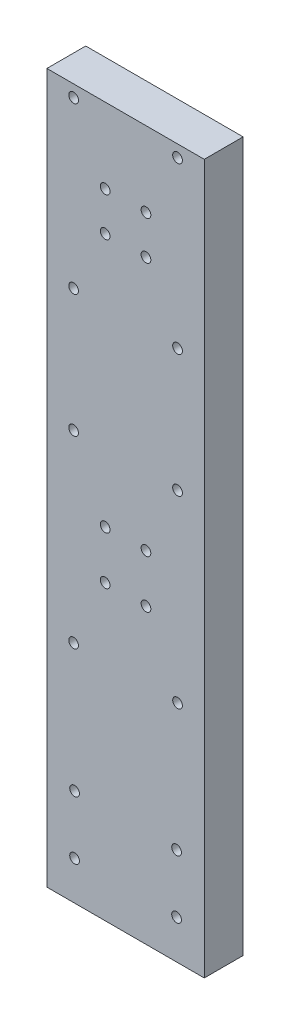
ISO-10303-21;
HEADER;
FILE_DESCRIPTION(('STEP AP214'),'2;1');
FILE_NAME('part.step','',(''),(''),'','','');
FILE_SCHEMA(('AUTOMOTIVE_DESIGN { 1 0 10303 214 1 1 1 1 }'));
ENDSEC;
DATA;
#1=APPLICATION_CONTEXT('core data for automotive mechanical design processes');
#2=APPLICATION_PROTOCOL_DEFINITION('international standard','automotive_design',2000,#1);
#3=PRODUCT_CONTEXT('',#1,'mechanical');
#4=PRODUCT('Part','Part','',(#3));
#5=PRODUCT_RELATED_PRODUCT_CATEGORY('part','',(#4));
#6=PRODUCT_DEFINITION_FORMATION('','',#4);
#7=PRODUCT_DEFINITION_CONTEXT('part definition',#1,'design');
#8=PRODUCT_DEFINITION('design','',#6,#7);
#9=PRODUCT_DEFINITION_SHAPE('','',#8);
#10=(LENGTH_UNIT() NAMED_UNIT(*) SI_UNIT(.MILLI.,.METRE.));
#11=(NAMED_UNIT(*) PLANE_ANGLE_UNIT() SI_UNIT($,.RADIAN.));
#12=(NAMED_UNIT(*) SI_UNIT($,.STERADIAN.) SOLID_ANGLE_UNIT());
#13=UNCERTAINTY_MEASURE_WITH_UNIT(LENGTH_MEASURE(1.E-05),#10,'distance_accuracy_value','');
#14=(GEOMETRIC_REPRESENTATION_CONTEXT(3) GLOBAL_UNCERTAINTY_ASSIGNED_CONTEXT((#13)) GLOBAL_UNIT_ASSIGNED_CONTEXT((#10,
#11,#12)) REPRESENTATION_CONTEXT('',''));
#15=CARTESIAN_POINT('',(0.,0.,0.));
#16=DIRECTION('',(0.,0.,1.));
#17=DIRECTION('',(1.,0.,0.));
#18=AXIS2_PLACEMENT_3D('',#15,#16,#17);
#19=CARTESIAN_POINT('',(0.,0.,4.));
#20=DIRECTION('',(0.,0.,-1.));
#21=DIRECTION('',(-1.,0.,0.));
#22=AXIS2_PLACEMENT_3D('',#19,#20,#21);
#23=PLANE('',#22);
#24=CARTESIAN_POINT('',(10.1999999999987,65.26,4.));
#25=DIRECTION('',(0.,0.,1.));
#26=DIRECTION('',(-1.,0.,0.));
#27=AXIS2_PLACEMENT_3D('',#24,#25,#26);
#28=CIRCLE('',#27,0.499999999999999);
#29=CARTESIAN_POINT('',(9.69999999999869,65.26,4.));
#30=VERTEX_POINT('',#29);
#31=EDGE_CURVE('E217',#30,#30,#28,.T.);
#32=ORIENTED_EDGE('',*,*,#31,.F.);
#33=EDGE_LOOP('',(#32));
#34=FACE_BOUND('',#33,.T.);
#35=CARTESIAN_POINT('',(2.7500000000006,54.76,4.));
#36=DIRECTION('',(0.,0.,1.));
#37=DIRECTION('',(1.,0.,0.));
#38=AXIS2_PLACEMENT_3D('',#35,#36,#37);
#39=CIRCLE('',#38,0.500000000000005);
#40=CARTESIAN_POINT('',(3.2500000000006,54.76,4.));
#41=VERTEX_POINT('',#40);
#42=EDGE_CURVE('E205',#41,#41,#39,.T.);
#43=ORIENTED_EDGE('',*,*,#42,.F.);
#44=EDGE_LOOP('',(#43));
#45=FACE_BOUND('',#44,.T.);
#46=CARTESIAN_POINT('',(13.350000000001,10.,4.));
#47=DIRECTION('',(0.,0.,1.));
#48=DIRECTION('',(-1.,0.,0.));
#49=AXIS2_PLACEMENT_3D('',#46,#47,#48);
#50=CIRCLE('',#49,0.499999999999994);
#51=CARTESIAN_POINT('',(12.850000000001,10.,4.));
#52=VERTEX_POINT('',#51);
#53=EDGE_CURVE('E193',#52,#52,#50,.T.);
#54=ORIENTED_EDGE('',*,*,#53,.F.);
#55=EDGE_LOOP('',(#54));
#56=FACE_BOUND('',#55,.T.);
#57=CARTESIAN_POINT('',(13.4500000000019,54.76,4.));
#58=DIRECTION('',(0.,0.,1.));
#59=DIRECTION('',(1.,0.,0.));
#60=AXIS2_PLACEMENT_3D('',#57,#58,#59);
#61=CIRCLE('',#60,0.499999999999999);
#62=CARTESIAN_POINT('',(13.9500000000019,54.76,4.));
#63=VERTEX_POINT('',#62);
#64=EDGE_CURVE('E181',#63,#63,#61,.T.);
#65=ORIENTED_EDGE('',*,*,#64,.F.);
#66=EDGE_LOOP('',(#65));
#67=FACE_BOUND('',#66,.T.);
#68=CARTESIAN_POINT('',(2.84999999999999,10.,4.));
#69=DIRECTION('',(0.,0.,1.));
#70=DIRECTION('',(1.,0.,0.));
#71=AXIS2_PLACEMENT_3D('',#68,#69,#70);
#72=CIRCLE('',#71,0.499999999999999);
#73=CARTESIAN_POINT('',(3.34999999999999,10.,4.));
#74=VERTEX_POINT('',#73);
#75=EDGE_CURVE('E169',#74,#74,#72,.T.);
#76=ORIENTED_EDGE('',*,*,#75,.F.);
#77=EDGE_LOOP('',(#76));
#78=FACE_BOUND('',#77,.T.);
#79=CARTESIAN_POINT('',(6.00000000000001,35.11,4.));
#80=DIRECTION('',(0.,0.,1.));
#81=DIRECTION('',(1.,0.,0.));
#82=AXIS2_PLACEMENT_3D('',#79,#80,#81);
#83=CIRCLE('',#82,0.500000000000002);
#84=CARTESIAN_POINT('',(6.50000000000001,35.11,4.));
#85=VERTEX_POINT('',#84);
#86=EDGE_CURVE('E157',#85,#85,#83,.T.);
#87=ORIENTED_EDGE('',*,*,#86,.F.);
#88=EDGE_LOOP('',(#87));
#89=FACE_BOUND('',#88,.T.);
#90=CARTESIAN_POINT('',(10.2000000000001,35.11,4.));
#91=DIRECTION('',(0.,0.,1.));
#92=DIRECTION('',(1.,0.,0.));
#93=AXIS2_PLACEMENT_3D('',#90,#91,#92);
#94=CIRCLE('',#93,0.499999999999999);
#95=CARTESIAN_POINT('',(10.7000000000001,35.11,4.));
#96=VERTEX_POINT('',#95);
#97=EDGE_CURVE('E145',#96,#96,#94,.T.);
#98=ORIENTED_EDGE('',*,*,#97,.F.);
#99=EDGE_LOOP('',(#98));
#100=FACE_BOUND('',#99,.T.);
#101=CARTESIAN_POINT('',(6.00000000000001,30.15,4.));
#102=DIRECTION('',(0.,0.,1.));
#103=DIRECTION('',(1.,0.,0.));
#104=AXIS2_PLACEMENT_3D('',#101,#102,#103);
#105=CIRCLE('',#104,0.5);
#106=CARTESIAN_POINT('',(6.50000000000001,30.15,4.));
#107=VERTEX_POINT('',#106);
#108=EDGE_CURVE('E133',#107,#107,#105,.T.);
#109=ORIENTED_EDGE('',*,*,#108,.F.);
#110=EDGE_LOOP('',(#109));
#111=FACE_BOUND('',#110,.T.);
#112=CARTESIAN_POINT('',(5.99999999999857,61.26,4.));
#113=DIRECTION('',(0.,0.,1.));
#114=DIRECTION('',(1.,0.,0.));
#115=AXIS2_PLACEMENT_3D('',#112,#113,#114);
#116=CIRCLE('',#115,0.500000000000003);
#117=CARTESIAN_POINT('',(6.49999999999857,61.26,4.));
#118=VERTEX_POINT('',#117);
#119=EDGE_CURVE('E121',#118,#118,#116,.T.);
#120=ORIENTED_EDGE('',*,*,#119,.F.);
#121=EDGE_LOOP('',(#120));
#122=FACE_BOUND('',#121,.T.);
#123=CARTESIAN_POINT('',(2.75000000000059,71.76,4.));
#124=DIRECTION('',(0.,0.,1.));
#125=DIRECTION('',(-1.,0.,0.));
#126=AXIS2_PLACEMENT_3D('',#123,#124,#125);
#127=CIRCLE('',#126,0.500000000000005);
#128=CARTESIAN_POINT('',(2.25000000000058,71.76,4.));
#129=VERTEX_POINT('',#128);
#130=EDGE_CURVE('E100',#129,#129,#127,.T.);
#131=ORIENTED_EDGE('',*,*,#130,.F.);
#132=EDGE_LOOP('',(#131));
#133=FACE_BOUND('',#132,.T.);
#134=DIRECTION('',(1.,0.,0.));
#135=VECTOR('',#134,1.);
#136=CARTESIAN_POINT('',(0.,0.,4.));
#137=LINE('',#136,#135);
#138=CARTESIAN_POINT('',(0.,0.,4.));
#139=VERTEX_POINT('',#138);
#140=CARTESIAN_POINT('',(16.2,0.,4.));
#141=VERTEX_POINT('',#140);
#142=EDGE_CURVE('E85',#139,#141,#137,.T.);
#143=ORIENTED_EDGE('',*,*,#142,.T.);
#144=DIRECTION('',(0.,1.,0.));
#145=VECTOR('',#144,1.);
#146=CARTESIAN_POINT('',(16.2,72.99,4.));
#147=LINE('',#146,#145);
#148=CARTESIAN_POINT('',(16.2,72.99,4.));
#149=VERTEX_POINT('',#148);
#150=EDGE_CURVE('E80',#141,#149,#147,.T.);
#151=ORIENTED_EDGE('',*,*,#150,.T.);
#152=DIRECTION('',(-1.,0.,0.));
#153=VECTOR('',#152,1.);
#154=CARTESIAN_POINT('',(0.,72.99,4.));
#155=LINE('',#154,#153);
#156=CARTESIAN_POINT('',(0.,72.99,4.));
#157=VERTEX_POINT('',#156);
#158=EDGE_CURVE('E83',#149,#157,#155,.T.);
#159=ORIENTED_EDGE('',*,*,#158,.T.);
#160=DIRECTION('',(0.,-1.,0.));
#161=VECTOR('',#160,1.);
#162=CARTESIAN_POINT('',(0.,0.,4.));
#163=LINE('',#162,#161);
#164=EDGE_CURVE('E50',#157,#139,#163,.T.);
#165=ORIENTED_EDGE('',*,*,#164,.T.);
#166=EDGE_LOOP('',(#143,#151,#159,#165));
#167=FACE_BOUND('',#166,.T.);
#168=CARTESIAN_POINT('',(10.1999999999987,61.26,4.));
#169=DIRECTION('',(0.,0.,1.));
#170=DIRECTION('',(1.,0.,0.));
#171=AXIS2_PLACEMENT_3D('',#168,#169,#170);
#172=CIRCLE('',#171,0.499999999999999);
#173=CARTESIAN_POINT('',(10.6999999999987,61.26,4.));
#174=VERTEX_POINT('',#173);
#175=EDGE_CURVE('E115',#174,#174,#172,.T.);
#176=ORIENTED_EDGE('',*,*,#175,.F.);
#177=EDGE_LOOP('',(#176));
#178=FACE_BOUND('',#177,.T.);
#179=CARTESIAN_POINT('',(10.2000000000001,30.15,4.));
#180=DIRECTION('',(0.,0.,1.));
#181=DIRECTION('',(1.,0.,0.));
#182=AXIS2_PLACEMENT_3D('',#179,#180,#181);
#183=CIRCLE('',#182,0.499999999999999);
#184=CARTESIAN_POINT('',(10.7000000000001,30.15,4.));
#185=VERTEX_POINT('',#184);
#186=EDGE_CURVE('E127',#185,#185,#183,.T.);
#187=ORIENTED_EDGE('',*,*,#186,.F.);
#188=EDGE_LOOP('',(#187));
#189=FACE_BOUND('',#188,.T.);
#190=CARTESIAN_POINT('',(13.4500000000001,23.15,4.));
#191=DIRECTION('',(0.,0.,1.));
#192=DIRECTION('',(1.,0.,0.));
#193=AXIS2_PLACEMENT_3D('',#190,#191,#192);
#194=CIRCLE('',#193,0.499999999999999);
#195=CARTESIAN_POINT('',(13.9500000000001,23.15,4.));
#196=VERTEX_POINT('',#195);
#197=EDGE_CURVE('E139',#196,#196,#194,.T.);
#198=ORIENTED_EDGE('',*,*,#197,.F.);
#199=EDGE_LOOP('',(#198));
#200=FACE_BOUND('',#199,.T.);
#201=CARTESIAN_POINT('',(2.75000000000003,23.15,4.));
#202=DIRECTION('',(0.,0.,1.));
#203=DIRECTION('',(1.,0.,0.));
#204=AXIS2_PLACEMENT_3D('',#201,#202,#203);
#205=CIRCLE('',#204,0.499999999999999);
#206=CARTESIAN_POINT('',(3.25000000000003,23.15,4.));
#207=VERTEX_POINT('',#206);
#208=EDGE_CURVE('E151',#207,#207,#205,.T.);
#209=ORIENTED_EDGE('',*,*,#208,.F.);
#210=EDGE_LOOP('',(#209));
#211=FACE_BOUND('',#210,.T.);
#212=CARTESIAN_POINT('',(13.45,42.11,4.));
#213=DIRECTION('',(0.,0.,1.));
#214=DIRECTION('',(1.,0.,0.));
#215=AXIS2_PLACEMENT_3D('',#212,#213,#214);
#216=CIRCLE('',#215,0.499999999999999);
#217=CARTESIAN_POINT('',(13.95,42.11,4.));
#218=VERTEX_POINT('',#217);
#219=EDGE_CURVE('E163',#218,#218,#216,.T.);
#220=ORIENTED_EDGE('',*,*,#219,.F.);
#221=EDGE_LOOP('',(#220));
#222=FACE_BOUND('',#221,.T.);
#223=CARTESIAN_POINT('',(2.75000000000003,42.11,4.));
#224=DIRECTION('',(0.,0.,1.));
#225=DIRECTION('',(1.,0.,0.));
#226=AXIS2_PLACEMENT_3D('',#223,#224,#225);
#227=CIRCLE('',#226,0.499999999999999);
#228=CARTESIAN_POINT('',(3.25000000000003,42.11,4.));
#229=VERTEX_POINT('',#228);
#230=EDGE_CURVE('E175',#229,#229,#227,.T.);
#231=ORIENTED_EDGE('',*,*,#230,.F.);
#232=EDGE_LOOP('',(#231));
#233=FACE_BOUND('',#232,.T.);
#234=CARTESIAN_POINT('',(2.84999999999999,4.,4.));
#235=DIRECTION('',(0.,0.,1.));
#236=DIRECTION('',(1.,0.,0.));
#237=AXIS2_PLACEMENT_3D('',#234,#235,#236);
#238=CIRCLE('',#237,0.499999999999999);
#239=CARTESIAN_POINT('',(3.34999999999999,4.,4.));
#240=VERTEX_POINT('',#239);
#241=EDGE_CURVE('E187',#240,#240,#238,.T.);
#242=ORIENTED_EDGE('',*,*,#241,.F.);
#243=EDGE_LOOP('',(#242));
#244=FACE_BOUND('',#243,.T.);
#245=CARTESIAN_POINT('',(13.350000000001,4.,4.));
#246=DIRECTION('',(0.,0.,1.));
#247=DIRECTION('',(-1.,0.,0.));
#248=AXIS2_PLACEMENT_3D('',#245,#246,#247);
#249=CIRCLE('',#248,0.499999999999995);
#250=CARTESIAN_POINT('',(12.850000000001,4.,4.));
#251=VERTEX_POINT('',#250);
#252=EDGE_CURVE('E199',#251,#251,#249,.T.);
#253=ORIENTED_EDGE('',*,*,#252,.F.);
#254=EDGE_LOOP('',(#253));
#255=FACE_BOUND('',#254,.T.);
#256=CARTESIAN_POINT('',(5.99999999999856,65.26,4.));
#257=DIRECTION('',(0.,0.,1.));
#258=DIRECTION('',(-1.,0.,0.));
#259=AXIS2_PLACEMENT_3D('',#256,#257,#258);
#260=CIRCLE('',#259,0.500000000000003);
#261=CARTESIAN_POINT('',(5.49999999999856,65.26,4.));
#262=VERTEX_POINT('',#261);
#263=EDGE_CURVE('E211',#262,#262,#260,.T.);
#264=ORIENTED_EDGE('',*,*,#263,.F.);
#265=EDGE_LOOP('',(#264));
#266=FACE_BOUND('',#265,.T.);
#267=CARTESIAN_POINT('',(13.4500000000019,71.76,4.));
#268=DIRECTION('',(0.,0.,1.));
#269=DIRECTION('',(-1.,0.,0.));
#270=AXIS2_PLACEMENT_3D('',#267,#268,#269);
#271=CIRCLE('',#270,0.500000000000006);
#272=CARTESIAN_POINT('',(12.9500000000019,71.76,4.));
#273=VERTEX_POINT('',#272);
#274=EDGE_CURVE('E223',#273,#273,#271,.T.);
#275=ORIENTED_EDGE('',*,*,#274,.F.);
#276=EDGE_LOOP('',(#275));
#277=FACE_BOUND('',#276,.T.);
#278=ADVANCED_FACE('F33',(#34,#45,#56,#67,#78,#89,#100,#111,#122,#133,#167,#178,#189,#200,#211,
#222,#233,#244,#255,#266,#277),#23,.F.);
#279=CARTESIAN_POINT('',(0.,0.,0.));
#280=DIRECTION('',(0.,0.,-1.));
#281=DIRECTION('',(-1.,0.,0.));
#282=AXIS2_PLACEMENT_3D('',#279,#280,#281);
#283=PLANE('',#282);
#284=CARTESIAN_POINT('',(10.1999999999987,65.26,0.));
#285=DIRECTION('',(0.,0.,1.));
#286=DIRECTION('',(-1.,0.,0.));
#287=AXIS2_PLACEMENT_3D('',#284,#285,#286);
#288=CIRCLE('',#287,0.499999999999999);
#289=CARTESIAN_POINT('',(9.69999999999869,65.26,0.));
#290=VERTEX_POINT('',#289);
#291=EDGE_CURVE('E220',#290,#290,#288,.T.);
#292=ORIENTED_EDGE('',*,*,#291,.T.);
#293=EDGE_LOOP('',(#292));
#294=FACE_BOUND('',#293,.T.);
#295=CARTESIAN_POINT('',(2.7500000000006,54.76,0.));
#296=DIRECTION('',(0.,0.,1.));
#297=DIRECTION('',(1.,0.,0.));
#298=AXIS2_PLACEMENT_3D('',#295,#296,#297);
#299=CIRCLE('',#298,0.500000000000005);
#300=CARTESIAN_POINT('',(3.2500000000006,54.76,0.));
#301=VERTEX_POINT('',#300);
#302=EDGE_CURVE('E208',#301,#301,#299,.T.);
#303=ORIENTED_EDGE('',*,*,#302,.T.);
#304=EDGE_LOOP('',(#303));
#305=FACE_BOUND('',#304,.T.);
#306=CARTESIAN_POINT('',(13.350000000001,10.,0.));
#307=DIRECTION('',(0.,0.,1.));
#308=DIRECTION('',(-1.,0.,0.));
#309=AXIS2_PLACEMENT_3D('',#306,#307,#308);
#310=CIRCLE('',#309,0.499999999999994);
#311=CARTESIAN_POINT('',(12.850000000001,10.,0.));
#312=VERTEX_POINT('',#311);
#313=EDGE_CURVE('E196',#312,#312,#310,.T.);
#314=ORIENTED_EDGE('',*,*,#313,.T.);
#315=EDGE_LOOP('',(#314));
#316=FACE_BOUND('',#315,.T.);
#317=CARTESIAN_POINT('',(13.4500000000019,54.76,0.));
#318=DIRECTION('',(0.,0.,1.));
#319=DIRECTION('',(1.,0.,0.));
#320=AXIS2_PLACEMENT_3D('',#317,#318,#319);
#321=CIRCLE('',#320,0.499999999999999);
#322=CARTESIAN_POINT('',(13.9500000000019,54.76,0.));
#323=VERTEX_POINT('',#322);
#324=EDGE_CURVE('E184',#323,#323,#321,.T.);
#325=ORIENTED_EDGE('',*,*,#324,.T.);
#326=EDGE_LOOP('',(#325));
#327=FACE_BOUND('',#326,.T.);
#328=CARTESIAN_POINT('',(2.84999999999999,10.,0.));
#329=DIRECTION('',(0.,0.,1.));
#330=DIRECTION('',(1.,0.,0.));
#331=AXIS2_PLACEMENT_3D('',#328,#329,#330);
#332=CIRCLE('',#331,0.499999999999999);
#333=CARTESIAN_POINT('',(3.34999999999999,10.,0.));
#334=VERTEX_POINT('',#333);
#335=EDGE_CURVE('E172',#334,#334,#332,.T.);
#336=ORIENTED_EDGE('',*,*,#335,.T.);
#337=EDGE_LOOP('',(#336));
#338=FACE_BOUND('',#337,.T.);
#339=CARTESIAN_POINT('',(6.00000000000001,35.11,0.));
#340=DIRECTION('',(0.,0.,1.));
#341=DIRECTION('',(1.,0.,0.));
#342=AXIS2_PLACEMENT_3D('',#339,#340,#341);
#343=CIRCLE('',#342,0.500000000000002);
#344=CARTESIAN_POINT('',(6.50000000000001,35.11,0.));
#345=VERTEX_POINT('',#344);
#346=EDGE_CURVE('E160',#345,#345,#343,.T.);
#347=ORIENTED_EDGE('',*,*,#346,.T.);
#348=EDGE_LOOP('',(#347));
#349=FACE_BOUND('',#348,.T.);
#350=CARTESIAN_POINT('',(10.2000000000001,35.11,0.));
#351=DIRECTION('',(0.,0.,1.));
#352=DIRECTION('',(1.,0.,0.));
#353=AXIS2_PLACEMENT_3D('',#350,#351,#352);
#354=CIRCLE('',#353,0.499999999999999);
#355=CARTESIAN_POINT('',(10.7000000000001,35.11,0.));
#356=VERTEX_POINT('',#355);
#357=EDGE_CURVE('E148',#356,#356,#354,.T.);
#358=ORIENTED_EDGE('',*,*,#357,.T.);
#359=EDGE_LOOP('',(#358));
#360=FACE_BOUND('',#359,.T.);
#361=CARTESIAN_POINT('',(6.00000000000001,30.15,0.));
#362=DIRECTION('',(0.,0.,1.));
#363=DIRECTION('',(1.,0.,0.));
#364=AXIS2_PLACEMENT_3D('',#361,#362,#363);
#365=CIRCLE('',#364,0.5);
#366=CARTESIAN_POINT('',(6.50000000000001,30.15,0.));
#367=VERTEX_POINT('',#366);
#368=EDGE_CURVE('E136',#367,#367,#365,.T.);
#369=ORIENTED_EDGE('',*,*,#368,.T.);
#370=EDGE_LOOP('',(#369));
#371=FACE_BOUND('',#370,.T.);
#372=CARTESIAN_POINT('',(5.99999999999857,61.26,0.));
#373=DIRECTION('',(0.,0.,1.));
#374=DIRECTION('',(1.,0.,0.));
#375=AXIS2_PLACEMENT_3D('',#372,#373,#374);
#376=CIRCLE('',#375,0.500000000000003);
#377=CARTESIAN_POINT('',(6.49999999999857,61.26,0.));
#378=VERTEX_POINT('',#377);
#379=EDGE_CURVE('E124',#378,#378,#376,.T.);
#380=ORIENTED_EDGE('',*,*,#379,.T.);
#381=EDGE_LOOP('',(#380));
#382=FACE_BOUND('',#381,.T.);
#383=CARTESIAN_POINT('',(2.75000000000059,71.76,0.));
#384=DIRECTION('',(0.,0.,1.));
#385=DIRECTION('',(-1.,0.,0.));
#386=AXIS2_PLACEMENT_3D('',#383,#384,#385);
#387=CIRCLE('',#386,0.500000000000005);
#388=CARTESIAN_POINT('',(2.25000000000058,71.76,0.));
#389=VERTEX_POINT('',#388);
#390=EDGE_CURVE('E112',#389,#389,#387,.T.);
#391=ORIENTED_EDGE('',*,*,#390,.T.);
#392=EDGE_LOOP('',(#391));
#393=FACE_BOUND('',#392,.T.);
#394=DIRECTION('',(1.,0.,0.));
#395=VECTOR('',#394,1.);
#396=CARTESIAN_POINT('',(0.,0.,0.));
#397=LINE('',#396,#395);
#398=CARTESIAN_POINT('',(0.,0.,0.));
#399=VERTEX_POINT('',#398);
#400=CARTESIAN_POINT('',(16.2,0.,0.));
#401=VERTEX_POINT('',#400);
#402=EDGE_CURVE('E97',#399,#401,#397,.T.);
#403=ORIENTED_EDGE('',*,*,#402,.F.);
#404=DIRECTION('',(0.,-1.,0.));
#405=VECTOR('',#404,1.);
#406=CARTESIAN_POINT('',(0.,0.,0.));
#407=LINE('',#406,#405);
#408=CARTESIAN_POINT('',(0.,72.99,0.));
#409=VERTEX_POINT('',#408);
#410=EDGE_CURVE('E73',#409,#399,#407,.T.);
#411=ORIENTED_EDGE('',*,*,#410,.F.);
#412=DIRECTION('',(-1.,0.,0.));
#413=VECTOR('',#412,1.);
#414=CARTESIAN_POINT('',(0.,72.99,0.));
#415=LINE('',#414,#413);
#416=CARTESIAN_POINT('',(16.2,72.99,0.));
#417=VERTEX_POINT('',#416);
#418=EDGE_CURVE('E67',#417,#409,#415,.T.);
#419=ORIENTED_EDGE('',*,*,#418,.F.);
#420=DIRECTION('',(0.,1.,0.));
#421=VECTOR('',#420,1.);
#422=CARTESIAN_POINT('',(16.2,72.99,0.));
#423=LINE('',#422,#421);
#424=EDGE_CURVE('E89',#401,#417,#423,.T.);
#425=ORIENTED_EDGE('',*,*,#424,.F.);
#426=EDGE_LOOP('',(#403,#411,#419,#425));
#427=FACE_BOUND('',#426,.T.);
#428=CARTESIAN_POINT('',(10.1999999999987,61.26,0.));
#429=DIRECTION('',(0.,0.,1.));
#430=DIRECTION('',(1.,0.,0.));
#431=AXIS2_PLACEMENT_3D('',#428,#429,#430);
#432=CIRCLE('',#431,0.499999999999999);
#433=CARTESIAN_POINT('',(10.6999999999987,61.26,0.));
#434=VERTEX_POINT('',#433);
#435=EDGE_CURVE('E118',#434,#434,#432,.T.);
#436=ORIENTED_EDGE('',*,*,#435,.T.);
#437=EDGE_LOOP('',(#436));
#438=FACE_BOUND('',#437,.T.);
#439=CARTESIAN_POINT('',(10.2000000000001,30.15,0.));
#440=DIRECTION('',(0.,0.,1.));
#441=DIRECTION('',(1.,0.,0.));
#442=AXIS2_PLACEMENT_3D('',#439,#440,#441);
#443=CIRCLE('',#442,0.499999999999999);
#444=CARTESIAN_POINT('',(10.7000000000001,30.15,0.));
#445=VERTEX_POINT('',#444);
#446=EDGE_CURVE('E130',#445,#445,#443,.T.);
#447=ORIENTED_EDGE('',*,*,#446,.T.);
#448=EDGE_LOOP('',(#447));
#449=FACE_BOUND('',#448,.T.);
#450=CARTESIAN_POINT('',(13.4500000000001,23.15,0.));
#451=DIRECTION('',(0.,0.,1.));
#452=DIRECTION('',(1.,0.,0.));
#453=AXIS2_PLACEMENT_3D('',#450,#451,#452);
#454=CIRCLE('',#453,0.499999999999999);
#455=CARTESIAN_POINT('',(13.9500000000001,23.15,0.));
#456=VERTEX_POINT('',#455);
#457=EDGE_CURVE('E142',#456,#456,#454,.T.);
#458=ORIENTED_EDGE('',*,*,#457,.T.);
#459=EDGE_LOOP('',(#458));
#460=FACE_BOUND('',#459,.T.);
#461=CARTESIAN_POINT('',(2.75000000000003,23.15,0.));
#462=DIRECTION('',(0.,0.,1.));
#463=DIRECTION('',(1.,0.,0.));
#464=AXIS2_PLACEMENT_3D('',#461,#462,#463);
#465=CIRCLE('',#464,0.499999999999999);
#466=CARTESIAN_POINT('',(3.25000000000003,23.15,0.));
#467=VERTEX_POINT('',#466);
#468=EDGE_CURVE('E154',#467,#467,#465,.T.);
#469=ORIENTED_EDGE('',*,*,#468,.T.);
#470=EDGE_LOOP('',(#469));
#471=FACE_BOUND('',#470,.T.);
#472=CARTESIAN_POINT('',(13.45,42.11,0.));
#473=DIRECTION('',(0.,0.,1.));
#474=DIRECTION('',(1.,0.,0.));
#475=AXIS2_PLACEMENT_3D('',#472,#473,#474);
#476=CIRCLE('',#475,0.499999999999999);
#477=CARTESIAN_POINT('',(13.95,42.11,0.));
#478=VERTEX_POINT('',#477);
#479=EDGE_CURVE('E166',#478,#478,#476,.T.);
#480=ORIENTED_EDGE('',*,*,#479,.T.);
#481=EDGE_LOOP('',(#480));
#482=FACE_BOUND('',#481,.T.);
#483=CARTESIAN_POINT('',(2.75000000000003,42.11,0.));
#484=DIRECTION('',(0.,0.,1.));
#485=DIRECTION('',(1.,0.,0.));
#486=AXIS2_PLACEMENT_3D('',#483,#484,#485);
#487=CIRCLE('',#486,0.499999999999999);
#488=CARTESIAN_POINT('',(3.25000000000003,42.11,0.));
#489=VERTEX_POINT('',#488);
#490=EDGE_CURVE('E178',#489,#489,#487,.T.);
#491=ORIENTED_EDGE('',*,*,#490,.T.);
#492=EDGE_LOOP('',(#491));
#493=FACE_BOUND('',#492,.T.);
#494=CARTESIAN_POINT('',(2.84999999999999,4.,0.));
#495=DIRECTION('',(0.,0.,1.));
#496=DIRECTION('',(1.,0.,0.));
#497=AXIS2_PLACEMENT_3D('',#494,#495,#496);
#498=CIRCLE('',#497,0.499999999999999);
#499=CARTESIAN_POINT('',(3.34999999999999,4.,0.));
#500=VERTEX_POINT('',#499);
#501=EDGE_CURVE('E190',#500,#500,#498,.T.);
#502=ORIENTED_EDGE('',*,*,#501,.T.);
#503=EDGE_LOOP('',(#502));
#504=FACE_BOUND('',#503,.T.);
#505=CARTESIAN_POINT('',(13.350000000001,4.,0.));
#506=DIRECTION('',(0.,0.,1.));
#507=DIRECTION('',(-1.,0.,0.));
#508=AXIS2_PLACEMENT_3D('',#505,#506,#507);
#509=CIRCLE('',#508,0.499999999999995);
#510=CARTESIAN_POINT('',(12.850000000001,4.,0.));
#511=VERTEX_POINT('',#510);
#512=EDGE_CURVE('E202',#511,#511,#509,.T.);
#513=ORIENTED_EDGE('',*,*,#512,.T.);
#514=EDGE_LOOP('',(#513));
#515=FACE_BOUND('',#514,.T.);
#516=CARTESIAN_POINT('',(5.99999999999856,65.26,0.));
#517=DIRECTION('',(0.,0.,1.));
#518=DIRECTION('',(-1.,0.,0.));
#519=AXIS2_PLACEMENT_3D('',#516,#517,#518);
#520=CIRCLE('',#519,0.500000000000003);
#521=CARTESIAN_POINT('',(5.49999999999856,65.26,0.));
#522=VERTEX_POINT('',#521);
#523=EDGE_CURVE('E214',#522,#522,#520,.T.);
#524=ORIENTED_EDGE('',*,*,#523,.T.);
#525=EDGE_LOOP('',(#524));
#526=FACE_BOUND('',#525,.T.);
#527=CARTESIAN_POINT('',(13.4500000000019,71.76,0.));
#528=DIRECTION('',(0.,0.,1.));
#529=DIRECTION('',(-1.,0.,0.));
#530=AXIS2_PLACEMENT_3D('',#527,#528,#529);
#531=CIRCLE('',#530,0.500000000000006);
#532=CARTESIAN_POINT('',(12.9500000000019,71.76,0.));
#533=VERTEX_POINT('',#532);
#534=EDGE_CURVE('E226',#533,#533,#531,.T.);
#535=ORIENTED_EDGE('',*,*,#534,.T.);
#536=EDGE_LOOP('',(#535));
#537=FACE_BOUND('',#536,.T.);
#538=ADVANCED_FACE('F108',(#294,#305,#316,#327,#338,#349,#360,#371,#382,#393,#427,#438,#449,
#460,#471,#482,#493,#504,#515,#526,#537),#283,.T.);
#539=CARTESIAN_POINT('',(0.,0.,4.));
#540=DIRECTION('',(0.,1.,0.));
#541=DIRECTION('',(0.,0.,1.));
#542=AXIS2_PLACEMENT_3D('',#539,#540,#541);
#543=PLANE('',#542);
#544=ORIENTED_EDGE('',*,*,#402,.T.);
#545=DIRECTION('',(0.,0.,-1.));
#546=VECTOR('',#545,1.);
#547=CARTESIAN_POINT('',(16.2,0.,4.));
#548=LINE('',#547,#546);
#549=EDGE_CURVE('E11',#141,#401,#548,.T.);
#550=ORIENTED_EDGE('',*,*,#549,.F.);
#551=ORIENTED_EDGE('',*,*,#142,.F.);
#552=DIRECTION('',(0.,0.,-1.));
#553=VECTOR('',#552,1.);
#554=CARTESIAN_POINT('',(0.,0.,4.));
#555=LINE('',#554,#553);
#556=EDGE_CURVE('E93',#139,#399,#555,.T.);
#557=ORIENTED_EDGE('',*,*,#556,.T.);
#558=EDGE_LOOP('',(#544,#550,#551,#557));
#559=FACE_BOUND('',#558,.T.);
#560=ADVANCED_FACE('F35',(#559),#543,.F.);
#561=CARTESIAN_POINT('',(16.2,72.99,4.));
#562=DIRECTION('',(-1.,0.,0.));
#563=DIRECTION('',(0.,-1.,0.));
#564=AXIS2_PLACEMENT_3D('',#561,#562,#563);
#565=PLANE('',#564);
#566=ORIENTED_EDGE('',*,*,#424,.T.);
#567=DIRECTION('',(0.,0.,-1.));
#568=VECTOR('',#567,1.);
#569=CARTESIAN_POINT('',(16.2,72.99,4.));
#570=LINE('',#569,#568);
#571=EDGE_CURVE('E42',#149,#417,#570,.T.);
#572=ORIENTED_EDGE('',*,*,#571,.F.);
#573=ORIENTED_EDGE('',*,*,#150,.F.);
#574=ORIENTED_EDGE('',*,*,#549,.T.);
#575=EDGE_LOOP('',(#566,#572,#573,#574));
#576=FACE_BOUND('',#575,.T.);
#577=ADVANCED_FACE('F88',(#576),#565,.F.);
#578=CARTESIAN_POINT('',(0.,72.99,4.));
#579=DIRECTION('',(0.,-1.,0.));
#580=DIRECTION('',(0.,0.,-1.));
#581=AXIS2_PLACEMENT_3D('',#578,#579,#580);
#582=PLANE('',#581);
#583=ORIENTED_EDGE('',*,*,#418,.T.);
#584=DIRECTION('',(0.,0.,-1.));
#585=VECTOR('',#584,1.);
#586=CARTESIAN_POINT('',(0.,72.99,4.));
#587=LINE('',#586,#585);
#588=EDGE_CURVE('E90',#157,#409,#587,.T.);
#589=ORIENTED_EDGE('',*,*,#588,.F.);
#590=ORIENTED_EDGE('',*,*,#158,.F.);
#591=ORIENTED_EDGE('',*,*,#571,.T.);
#592=EDGE_LOOP('',(#583,#589,#590,#591));
#593=FACE_BOUND('',#592,.T.);
#594=ADVANCED_FACE('F91',(#593),#582,.F.);
#595=CARTESIAN_POINT('',(0.,0.,4.));
#596=DIRECTION('',(1.,0.,0.));
#597=DIRECTION('',(0.,0.,-1.));
#598=AXIS2_PLACEMENT_3D('',#595,#596,#597);
#599=PLANE('',#598);
#600=ORIENTED_EDGE('',*,*,#410,.T.);
#601=ORIENTED_EDGE('',*,*,#556,.F.);
#602=ORIENTED_EDGE('',*,*,#164,.F.);
#603=ORIENTED_EDGE('',*,*,#588,.T.);
#604=EDGE_LOOP('',(#600,#601,#602,#603));
#605=FACE_BOUND('',#604,.T.);
#606=ADVANCED_FACE('F105',(#605),#599,.F.);
#607=CARTESIAN_POINT('',(2.75000000000059,71.76,4.));
#608=DIRECTION('',(0.,0.,-1.));
#609=DIRECTION('',(-1.,0.,0.));
#610=AXIS2_PLACEMENT_3D('',#607,#608,#609);
#611=CYLINDRICAL_SURFACE('',#610,0.500000000000005);
#612=ORIENTED_EDGE('',*,*,#130,.T.);
#613=EDGE_LOOP('',(#612));
#614=FACE_BOUND('',#613,.T.);
#615=ORIENTED_EDGE('',*,*,#390,.F.);
#616=EDGE_LOOP('',(#615));
#617=FACE_BOUND('',#616,.T.);
#618=ADVANCED_FACE('F246',(#614,#617),#611,.F.);
#619=CARTESIAN_POINT('',(10.1999999999987,61.26,4.));
#620=DIRECTION('',(0.,0.,-1.));
#621=DIRECTION('',(-1.,0.,0.));
#622=AXIS2_PLACEMENT_3D('',#619,#620,#621);
#623=CYLINDRICAL_SURFACE('',#622,0.499999999999999);
#624=ORIENTED_EDGE('',*,*,#175,.T.);
#625=EDGE_LOOP('',(#624));
#626=FACE_BOUND('',#625,.T.);
#627=ORIENTED_EDGE('',*,*,#435,.F.);
#628=EDGE_LOOP('',(#627));
#629=FACE_BOUND('',#628,.T.);
#630=ADVANCED_FACE('F292',(#626,#629),#623,.F.);
#631=CARTESIAN_POINT('',(5.99999999999857,61.26,4.));
#632=DIRECTION('',(0.,0.,-1.));
#633=DIRECTION('',(-1.,0.,0.));
#634=AXIS2_PLACEMENT_3D('',#631,#632,#633);
#635=CYLINDRICAL_SURFACE('',#634,0.500000000000003);
#636=ORIENTED_EDGE('',*,*,#119,.T.);
#637=EDGE_LOOP('',(#636));
#638=FACE_BOUND('',#637,.T.);
#639=ORIENTED_EDGE('',*,*,#379,.F.);
#640=EDGE_LOOP('',(#639));
#641=FACE_BOUND('',#640,.T.);
#642=ADVANCED_FACE('F300',(#638,#641),#635,.F.);
#643=CARTESIAN_POINT('',(10.2000000000001,30.15,4.));
#644=DIRECTION('',(0.,0.,-1.));
#645=DIRECTION('',(-1.,0.,0.));
#646=AXIS2_PLACEMENT_3D('',#643,#644,#645);
#647=CYLINDRICAL_SURFACE('',#646,0.499999999999999);
#648=ORIENTED_EDGE('',*,*,#186,.T.);
#649=EDGE_LOOP('',(#648));
#650=FACE_BOUND('',#649,.T.);
#651=ORIENTED_EDGE('',*,*,#446,.F.);
#652=EDGE_LOOP('',(#651));
#653=FACE_BOUND('',#652,.T.);
#654=ADVANCED_FACE('F308',(#650,#653),#647,.F.);
#655=CARTESIAN_POINT('',(6.00000000000001,30.15,4.));
#656=DIRECTION('',(0.,0.,-1.));
#657=DIRECTION('',(-1.,0.,0.));
#658=AXIS2_PLACEMENT_3D('',#655,#656,#657);
#659=CYLINDRICAL_SURFACE('',#658,0.5);
#660=ORIENTED_EDGE('',*,*,#108,.T.);
#661=EDGE_LOOP('',(#660));
#662=FACE_BOUND('',#661,.T.);
#663=ORIENTED_EDGE('',*,*,#368,.F.);
#664=EDGE_LOOP('',(#663));
#665=FACE_BOUND('',#664,.T.);
#666=ADVANCED_FACE('F317',(#662,#665),#659,.F.);
#667=CARTESIAN_POINT('',(13.4500000000001,23.15,4.));
#668=DIRECTION('',(0.,0.,-1.));
#669=DIRECTION('',(-1.,0.,0.));
#670=AXIS2_PLACEMENT_3D('',#667,#668,#669);
#671=CYLINDRICAL_SURFACE('',#670,0.499999999999999);
#672=ORIENTED_EDGE('',*,*,#197,.T.);
#673=EDGE_LOOP('',(#672));
#674=FACE_BOUND('',#673,.T.);
#675=ORIENTED_EDGE('',*,*,#457,.F.);
#676=EDGE_LOOP('',(#675));
#677=FACE_BOUND('',#676,.T.);
#678=ADVANCED_FACE('F326',(#674,#677),#671,.F.);
#679=CARTESIAN_POINT('',(10.2000000000001,35.11,4.));
#680=DIRECTION('',(0.,0.,-1.));
#681=DIRECTION('',(-1.,0.,0.));
#682=AXIS2_PLACEMENT_3D('',#679,#680,#681);
#683=CYLINDRICAL_SURFACE('',#682,0.499999999999999);
#684=ORIENTED_EDGE('',*,*,#97,.T.);
#685=EDGE_LOOP('',(#684));
#686=FACE_BOUND('',#685,.T.);
#687=ORIENTED_EDGE('',*,*,#357,.F.);
#688=EDGE_LOOP('',(#687));
#689=FACE_BOUND('',#688,.T.);
#690=ADVANCED_FACE('F335',(#686,#689),#683,.F.);
#691=CARTESIAN_POINT('',(2.75000000000003,23.15,4.));
#692=DIRECTION('',(0.,0.,-1.));
#693=DIRECTION('',(-1.,0.,0.));
#694=AXIS2_PLACEMENT_3D('',#691,#692,#693);
#695=CYLINDRICAL_SURFACE('',#694,0.499999999999999);
#696=ORIENTED_EDGE('',*,*,#208,.T.);
#697=EDGE_LOOP('',(#696));
#698=FACE_BOUND('',#697,.T.);
#699=ORIENTED_EDGE('',*,*,#468,.F.);
#700=EDGE_LOOP('',(#699));
#701=FACE_BOUND('',#700,.T.);
#702=ADVANCED_FACE('F344',(#698,#701),#695,.F.);
#703=CARTESIAN_POINT('',(6.00000000000001,35.11,4.));
#704=DIRECTION('',(0.,0.,-1.));
#705=DIRECTION('',(-1.,0.,0.));
#706=AXIS2_PLACEMENT_3D('',#703,#704,#705);
#707=CYLINDRICAL_SURFACE('',#706,0.500000000000002);
#708=ORIENTED_EDGE('',*,*,#86,.T.);
#709=EDGE_LOOP('',(#708));
#710=FACE_BOUND('',#709,.T.);
#711=ORIENTED_EDGE('',*,*,#346,.F.);
#712=EDGE_LOOP('',(#711));
#713=FACE_BOUND('',#712,.T.);
#714=ADVANCED_FACE('F353',(#710,#713),#707,.F.);
#715=CARTESIAN_POINT('',(13.45,42.11,4.));
#716=DIRECTION('',(0.,0.,-1.));
#717=DIRECTION('',(-1.,0.,0.));
#718=AXIS2_PLACEMENT_3D('',#715,#716,#717);
#719=CYLINDRICAL_SURFACE('',#718,0.499999999999999);
#720=ORIENTED_EDGE('',*,*,#219,.T.);
#721=EDGE_LOOP('',(#720));
#722=FACE_BOUND('',#721,.T.);
#723=ORIENTED_EDGE('',*,*,#479,.F.);
#724=EDGE_LOOP('',(#723));
#725=FACE_BOUND('',#724,.T.);
#726=ADVANCED_FACE('F362',(#722,#725),#719,.F.);
#727=CARTESIAN_POINT('',(2.84999999999999,10.,4.));
#728=DIRECTION('',(0.,0.,-1.));
#729=DIRECTION('',(-1.,0.,0.));
#730=AXIS2_PLACEMENT_3D('',#727,#728,#729);
#731=CYLINDRICAL_SURFACE('',#730,0.499999999999999);
#732=ORIENTED_EDGE('',*,*,#75,.T.);
#733=EDGE_LOOP('',(#732));
#734=FACE_BOUND('',#733,.T.);
#735=ORIENTED_EDGE('',*,*,#335,.F.);
#736=EDGE_LOOP('',(#735));
#737=FACE_BOUND('',#736,.T.);
#738=ADVANCED_FACE('F371',(#734,#737),#731,.F.);
#739=CARTESIAN_POINT('',(2.75000000000003,42.11,4.));
#740=DIRECTION('',(0.,0.,-1.));
#741=DIRECTION('',(-1.,0.,0.));
#742=AXIS2_PLACEMENT_3D('',#739,#740,#741);
#743=CYLINDRICAL_SURFACE('',#742,0.499999999999999);
#744=ORIENTED_EDGE('',*,*,#230,.T.);
#745=EDGE_LOOP('',(#744));
#746=FACE_BOUND('',#745,.T.);
#747=ORIENTED_EDGE('',*,*,#490,.F.);
#748=EDGE_LOOP('',(#747));
#749=FACE_BOUND('',#748,.T.);
#750=ADVANCED_FACE('F380',(#746,#749),#743,.F.);
#751=CARTESIAN_POINT('',(13.4500000000019,54.76,4.));
#752=DIRECTION('',(0.,0.,-1.));
#753=DIRECTION('',(-1.,0.,0.));
#754=AXIS2_PLACEMENT_3D('',#751,#752,#753);
#755=CYLINDRICAL_SURFACE('',#754,0.499999999999999);
#756=ORIENTED_EDGE('',*,*,#64,.T.);
#757=EDGE_LOOP('',(#756));
#758=FACE_BOUND('',#757,.T.);
#759=ORIENTED_EDGE('',*,*,#324,.F.);
#760=EDGE_LOOP('',(#759));
#761=FACE_BOUND('',#760,.T.);
#762=ADVANCED_FACE('F389',(#758,#761),#755,.F.);
#763=CARTESIAN_POINT('',(2.84999999999999,4.,4.));
#764=DIRECTION('',(0.,0.,-1.));
#765=DIRECTION('',(-1.,0.,0.));
#766=AXIS2_PLACEMENT_3D('',#763,#764,#765);
#767=CYLINDRICAL_SURFACE('',#766,0.499999999999999);
#768=ORIENTED_EDGE('',*,*,#241,.T.);
#769=EDGE_LOOP('',(#768));
#770=FACE_BOUND('',#769,.T.);
#771=ORIENTED_EDGE('',*,*,#501,.F.);
#772=EDGE_LOOP('',(#771));
#773=FACE_BOUND('',#772,.T.);
#774=ADVANCED_FACE('F398',(#770,#773),#767,.F.);
#775=CARTESIAN_POINT('',(13.350000000001,10.,4.));
#776=DIRECTION('',(0.,0.,-1.));
#777=DIRECTION('',(-1.,0.,0.));
#778=AXIS2_PLACEMENT_3D('',#775,#776,#777);
#779=CYLINDRICAL_SURFACE('',#778,0.499999999999994);
#780=ORIENTED_EDGE('',*,*,#53,.T.);
#781=EDGE_LOOP('',(#780));
#782=FACE_BOUND('',#781,.T.);
#783=ORIENTED_EDGE('',*,*,#313,.F.);
#784=EDGE_LOOP('',(#783));
#785=FACE_BOUND('',#784,.T.);
#786=ADVANCED_FACE('F407',(#782,#785),#779,.F.);
#787=CARTESIAN_POINT('',(13.350000000001,4.,4.));
#788=DIRECTION('',(0.,0.,-1.));
#789=DIRECTION('',(-1.,0.,0.));
#790=AXIS2_PLACEMENT_3D('',#787,#788,#789);
#791=CYLINDRICAL_SURFACE('',#790,0.499999999999995);
#792=ORIENTED_EDGE('',*,*,#252,.T.);
#793=EDGE_LOOP('',(#792));
#794=FACE_BOUND('',#793,.T.);
#795=ORIENTED_EDGE('',*,*,#512,.F.);
#796=EDGE_LOOP('',(#795));
#797=FACE_BOUND('',#796,.T.);
#798=ADVANCED_FACE('F416',(#794,#797),#791,.F.);
#799=CARTESIAN_POINT('',(2.7500000000006,54.76,4.));
#800=DIRECTION('',(0.,0.,-1.));
#801=DIRECTION('',(-1.,0.,0.));
#802=AXIS2_PLACEMENT_3D('',#799,#800,#801);
#803=CYLINDRICAL_SURFACE('',#802,0.500000000000005);
#804=ORIENTED_EDGE('',*,*,#42,.T.);
#805=EDGE_LOOP('',(#804));
#806=FACE_BOUND('',#805,.T.);
#807=ORIENTED_EDGE('',*,*,#302,.F.);
#808=EDGE_LOOP('',(#807));
#809=FACE_BOUND('',#808,.T.);
#810=ADVANCED_FACE('F425',(#806,#809),#803,.F.);
#811=CARTESIAN_POINT('',(5.99999999999856,65.26,4.));
#812=DIRECTION('',(0.,0.,-1.));
#813=DIRECTION('',(-1.,0.,0.));
#814=AXIS2_PLACEMENT_3D('',#811,#812,#813);
#815=CYLINDRICAL_SURFACE('',#814,0.500000000000003);
#816=ORIENTED_EDGE('',*,*,#263,.T.);
#817=EDGE_LOOP('',(#816));
#818=FACE_BOUND('',#817,.T.);
#819=ORIENTED_EDGE('',*,*,#523,.F.);
#820=EDGE_LOOP('',(#819));
#821=FACE_BOUND('',#820,.T.);
#822=ADVANCED_FACE('F434',(#818,#821),#815,.F.);
#823=CARTESIAN_POINT('',(10.1999999999987,65.26,4.));
#824=DIRECTION('',(0.,0.,-1.));
#825=DIRECTION('',(-1.,0.,0.));
#826=AXIS2_PLACEMENT_3D('',#823,#824,#825);
#827=CYLINDRICAL_SURFACE('',#826,0.499999999999999);
#828=ORIENTED_EDGE('',*,*,#31,.T.);
#829=EDGE_LOOP('',(#828));
#830=FACE_BOUND('',#829,.T.);
#831=ORIENTED_EDGE('',*,*,#291,.F.);
#832=EDGE_LOOP('',(#831));
#833=FACE_BOUND('',#832,.T.);
#834=ADVANCED_FACE('F443',(#830,#833),#827,.F.);
#835=CARTESIAN_POINT('',(13.4500000000019,71.76,4.));
#836=DIRECTION('',(0.,0.,-1.));
#837=DIRECTION('',(-1.,0.,0.));
#838=AXIS2_PLACEMENT_3D('',#835,#836,#837);
#839=CYLINDRICAL_SURFACE('',#838,0.500000000000006);
#840=ORIENTED_EDGE('',*,*,#274,.T.);
#841=EDGE_LOOP('',(#840));
#842=FACE_BOUND('',#841,.T.);
#843=ORIENTED_EDGE('',*,*,#534,.F.);
#844=EDGE_LOOP('',(#843));
#845=FACE_BOUND('',#844,.T.);
#846=ADVANCED_FACE('F232',(#842,#845),#839,.F.);
#847=CLOSED_SHELL('',(#278,#538,#560,#577,#594,#606,#618,#630,#642,#654,#666,#678,#690,#702,
#714,#726,#738,#750,#762,#774,#786,#798,#810,#822,#834,#846));
#848=MANIFOLD_SOLID_BREP('B2',#847);
#849=ADVANCED_BREP_SHAPE_REPRESENTATION('',(#18,#848),#14);
#850=SHAPE_DEFINITION_REPRESENTATION(#9,#849);
ENDSEC;
END-ISO-10303-21;
